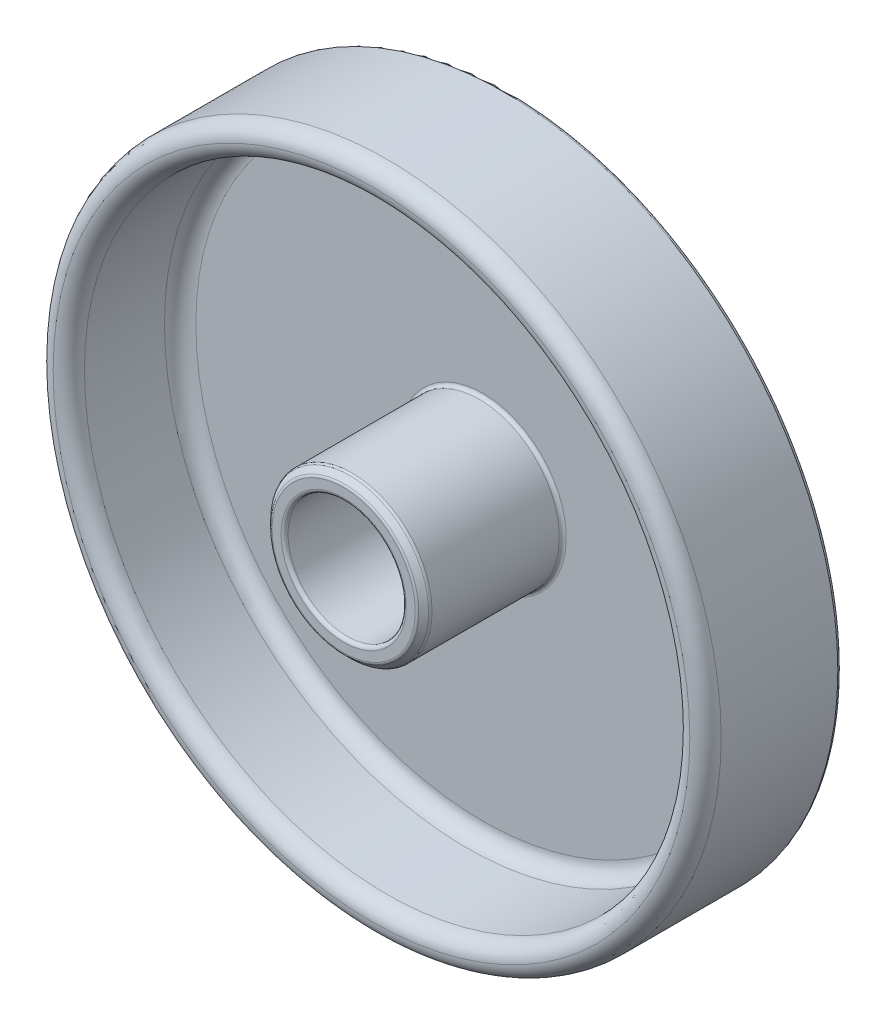
ISO-10303-21;
HEADER;
FILE_DESCRIPTION(('STEP AP214'),'2;1');
FILE_NAME('part.step','',(''),(''),'','','');
FILE_SCHEMA(('AUTOMOTIVE_DESIGN { 1 0 10303 214 1 1 1 1 }'));
ENDSEC;
DATA;
#1=APPLICATION_CONTEXT('core data for automotive mechanical design processes');
#2=APPLICATION_PROTOCOL_DEFINITION('international standard','automotive_design',2000,#1);
#3=PRODUCT_CONTEXT('',#1,'mechanical');
#4=PRODUCT('Part','Part','',(#3));
#5=PRODUCT_RELATED_PRODUCT_CATEGORY('part','',(#4));
#6=PRODUCT_DEFINITION_FORMATION('','',#4);
#7=PRODUCT_DEFINITION_CONTEXT('part definition',#1,'design');
#8=PRODUCT_DEFINITION('design','',#6,#7);
#9=PRODUCT_DEFINITION_SHAPE('','',#8);
#10=(LENGTH_UNIT() NAMED_UNIT(*) SI_UNIT(.MILLI.,.METRE.));
#11=(NAMED_UNIT(*) PLANE_ANGLE_UNIT() SI_UNIT($,.RADIAN.));
#12=(NAMED_UNIT(*) SI_UNIT($,.STERADIAN.) SOLID_ANGLE_UNIT());
#13=UNCERTAINTY_MEASURE_WITH_UNIT(LENGTH_MEASURE(1.E-05),#10,'distance_accuracy_value','');
#14=(GEOMETRIC_REPRESENTATION_CONTEXT(3) GLOBAL_UNCERTAINTY_ASSIGNED_CONTEXT((#13)) GLOBAL_UNIT_ASSIGNED_CONTEXT((#10,
#11,#12)) REPRESENTATION_CONTEXT('',''));
#15=CARTESIAN_POINT('',(0.,0.,0.));
#16=DIRECTION('',(0.,0.,1.));
#17=DIRECTION('',(1.,0.,0.));
#18=AXIS2_PLACEMENT_3D('',#15,#16,#17);
#19=CARTESIAN_POINT('',(0.,0.,-319.213461987817));
#20=DIRECTION('',(0.,0.,1.));
#21=DIRECTION('',(1.,0.,0.));
#22=AXIS2_PLACEMENT_3D('',#19,#20,#21);
#23=CYLINDRICAL_SURFACE('',#22,48.);
#24=CARTESIAN_POINT('',(0.,0.,-103.92448));
#25=DIRECTION('',(0.,0.,-1.));
#26=DIRECTION('',(-1.,0.,0.));
#27=AXIS2_PLACEMENT_3D('',#24,#25,#26);
#28=CIRCLE('',#27,48.);
#29=CARTESIAN_POINT('',(-48.,0.,-103.92448));
#30=VERTEX_POINT('',#29);
#31=EDGE_CURVE('E75',#30,#30,#28,.F.);
#32=ORIENTED_EDGE('',*,*,#31,.T.);
#33=EDGE_LOOP('',(#32));
#34=FACE_BOUND('',#33,.T.);
#35=CARTESIAN_POINT('',(0.,0.,-87.15));
#36=DIRECTION('',(0.,0.,1.));
#37=DIRECTION('',(1.,0.,0.));
#38=AXIS2_PLACEMENT_3D('',#35,#36,#37);
#39=CIRCLE('',#38,48.);
#40=CARTESIAN_POINT('',(48.,0.,-87.15));
#41=VERTEX_POINT('',#40);
#42=EDGE_CURVE('E87',#41,#41,#39,.F.);
#43=ORIENTED_EDGE('',*,*,#42,.T.);
#44=EDGE_LOOP('',(#43));
#45=FACE_BOUND('',#44,.T.);
#46=ADVANCED_FACE('F37',(#34,#45),#23,.T.);
#47=CARTESIAN_POINT('',(0.,0.,-104.42448));
#48=DIRECTION('',(0.,0.,-1.));
#49=DIRECTION('',(1.,0.,0.));
#50=AXIS2_PLACEMENT_3D('',#47,#48,#49);
#51=PLANE('',#50);
#52=CARTESIAN_POINT('',(0.,0.,-104.42448));
#53=DIRECTION('',(0.,0.,-1.));
#54=DIRECTION('',(-1.,0.,0.));
#55=AXIS2_PLACEMENT_3D('',#52,#53,#54);
#56=CIRCLE('',#55,43.5);
#57=CARTESIAN_POINT('',(-43.5,0.,-104.42448));
#58=VERTEX_POINT('',#57);
#59=EDGE_CURVE('E78',#58,#58,#56,.F.);
#60=ORIENTED_EDGE('',*,*,#59,.T.);
#61=EDGE_LOOP('',(#60));
#62=FACE_BOUND('',#61,.T.);
#63=CARTESIAN_POINT('',(0.,0.,-104.42448));
#64=DIRECTION('',(0.,0.,-1.));
#65=DIRECTION('',(-1.,0.,0.));
#66=AXIS2_PLACEMENT_3D('',#63,#64,#65);
#67=CIRCLE('',#66,47.5);
#68=CARTESIAN_POINT('',(-47.5,0.,-104.42448));
#69=VERTEX_POINT('',#68);
#70=EDGE_CURVE('E81',#69,#69,#67,.T.);
#71=ORIENTED_EDGE('',*,*,#70,.T.);
#72=EDGE_LOOP('',(#71));
#73=FACE_BOUND('',#72,.T.);
#74=ADVANCED_FACE('F125',(#62,#73),#51,.T.);
#75=CARTESIAN_POINT('',(0.,0.,-84.9));
#76=DIRECTION('',(0.,0.,-1.));
#77=DIRECTION('',(-1.,0.,0.));
#78=AXIS2_PLACEMENT_3D('',#75,#76,#77);
#79=CYLINDRICAL_SURFACE('',#78,43.5);
#80=CARTESIAN_POINT('',(0.,0.,-98.65));
#81=DIRECTION('',(0.,0.,-1.));
#82=DIRECTION('',(-1.,0.,0.));
#83=AXIS2_PLACEMENT_3D('',#80,#81,#82);
#84=CIRCLE('',#83,43.5);
#85=CARTESIAN_POINT('',(-43.5,0.,-98.65));
#86=VERTEX_POINT('',#85);
#87=EDGE_CURVE('E94',#86,#86,#84,.T.);
#88=ORIENTED_EDGE('',*,*,#87,.T.);
#89=EDGE_LOOP('',(#88));
#90=FACE_BOUND('',#89,.T.);
#91=CARTESIAN_POINT('',(0.,0.,-87.15));
#92=DIRECTION('',(0.,0.,1.));
#93=DIRECTION('',(1.,0.,0.));
#94=AXIS2_PLACEMENT_3D('',#91,#92,#93);
#95=CIRCLE('',#94,43.5);
#96=CARTESIAN_POINT('',(43.5,0.,-87.15));
#97=VERTEX_POINT('',#96);
#98=EDGE_CURVE('E97',#97,#97,#95,.T.);
#99=ORIENTED_EDGE('',*,*,#98,.T.);
#100=EDGE_LOOP('',(#99));
#101=FACE_BOUND('',#100,.T.);
#102=ADVANCED_FACE('F120',(#90,#101),#79,.F.);
#103=CARTESIAN_POINT('',(0.,0.,-100.9));
#104=DIRECTION('',(0.,0.,-1.));
#105=DIRECTION('',(-1.,0.,0.));
#106=AXIS2_PLACEMENT_3D('',#103,#104,#105);
#107=PLANE('',#106);
#108=CARTESIAN_POINT('',(0.,0.,-100.9));
#109=DIRECTION('',(0.,0.,-1.));
#110=DIRECTION('',(-1.,0.,0.));
#111=AXIS2_PLACEMENT_3D('',#108,#109,#110);
#112=CIRCLE('',#111,12.);
#113=CARTESIAN_POINT('',(-12.,0.,-100.9));
#114=VERTEX_POINT('',#113);
#115=EDGE_CURVE('E57',#114,#114,#112,.T.);
#116=ORIENTED_EDGE('',*,*,#115,.T.);
#117=EDGE_LOOP('',(#116));
#118=FACE_BOUND('',#117,.T.);
#119=CARTESIAN_POINT('',(0.,0.,-100.9));
#120=DIRECTION('',(0.,0.,-1.));
#121=DIRECTION('',(-1.,0.,0.));
#122=AXIS2_PLACEMENT_3D('',#119,#120,#121);
#123=CIRCLE('',#122,41.25);
#124=CARTESIAN_POINT('',(-41.25,0.,-100.9));
#125=VERTEX_POINT('',#124);
#126=EDGE_CURVE('E100',#125,#125,#123,.F.);
#127=ORIENTED_EDGE('',*,*,#126,.T.);
#128=EDGE_LOOP('',(#127));
#129=FACE_BOUND('',#128,.T.);
#130=ADVANCED_FACE('F110',(#118,#129),#107,.F.);
#131=CARTESIAN_POINT('',(0.,0.,-103.42448));
#132=DIRECTION('',(0.,0.,-1.));
#133=DIRECTION('',(-1.,0.,0.));
#134=AXIS2_PLACEMENT_3D('',#131,#132,#133);
#135=CYLINDRICAL_SURFACE('',#134,43.);
#136=CARTESIAN_POINT('',(0.,0.,-103.92448));
#137=DIRECTION('',(0.,0.,-1.));
#138=DIRECTION('',(-1.,0.,0.));
#139=AXIS2_PLACEMENT_3D('',#136,#137,#138);
#140=CIRCLE('',#139,43.);
#141=CARTESIAN_POINT('',(-43.,0.,-103.92448));
#142=VERTEX_POINT('',#141);
#143=EDGE_CURVE('E84',#142,#142,#140,.T.);
#144=ORIENTED_EDGE('',*,*,#143,.T.);
#145=EDGE_LOOP('',(#144));
#146=FACE_BOUND('',#145,.T.);
#147=CARTESIAN_POINT('',(0.,0.,-103.42448));
#148=DIRECTION('',(0.,0.,-1.));
#149=DIRECTION('',(-1.,0.,0.));
#150=AXIS2_PLACEMENT_3D('',#147,#148,#149);
#151=CIRCLE('',#150,43.);
#152=CARTESIAN_POINT('',(-43.,0.,-103.42448));
#153=VERTEX_POINT('',#152);
#154=EDGE_CURVE('E91',#153,#153,#151,.T.);
#155=ORIENTED_EDGE('',*,*,#154,.F.);
#156=EDGE_LOOP('',(#155));
#157=FACE_BOUND('',#156,.T.);
#158=ADVANCED_FACE('F108',(#146,#157),#135,.F.);
#159=CARTESIAN_POINT('',(0.,0.,-103.42448));
#160=DIRECTION('',(0.,0.,-1.));
#161=DIRECTION('',(-1.,0.,0.));
#162=AXIS2_PLACEMENT_3D('',#159,#160,#161);
#163=PLANE('',#162);
#164=CARTESIAN_POINT('',(0.,0.,-103.42448));
#165=DIRECTION('',(0.,0.,-1.));
#166=DIRECTION('',(-1.,0.,0.));
#167=AXIS2_PLACEMENT_3D('',#164,#165,#166);
#168=CIRCLE('',#167,9.);
#169=CARTESIAN_POINT('',(-9.,0.,-103.42448));
#170=VERTEX_POINT('',#169);
#171=EDGE_CURVE('E66',#170,#170,#168,.F.);
#172=ORIENTED_EDGE('',*,*,#171,.T.);
#173=EDGE_LOOP('',(#172));
#174=FACE_BOUND('',#173,.T.);
#175=ORIENTED_EDGE('',*,*,#154,.T.);
#176=EDGE_LOOP('',(#175));
#177=FACE_BOUND('',#176,.T.);
#178=ADVANCED_FACE('F106',(#174,#177),#163,.T.);
#179=CARTESIAN_POINT('',(0.,0.,-98.65));
#180=DIRECTION('',(0.,0.,-1.));
#181=DIRECTION('',(-1.,0.,0.));
#182=AXIS2_PLACEMENT_3D('',#179,#180,#181);
#183=TOROIDAL_SURFACE('',#182,41.25,2.25);
#184=ORIENTED_EDGE('',*,*,#87,.F.);
#185=EDGE_LOOP('',(#184));
#186=FACE_BOUND('',#185,.T.);
#187=ORIENTED_EDGE('',*,*,#126,.F.);
#188=EDGE_LOOP('',(#187));
#189=FACE_BOUND('',#188,.T.);
#190=ADVANCED_FACE('F117',(#186,#189),#183,.F.);
#191=CARTESIAN_POINT('',(0.,0.,-87.15));
#192=DIRECTION('',(0.,0.,1.));
#193=DIRECTION('',(1.,0.,0.));
#194=AXIS2_PLACEMENT_3D('',#191,#192,#193);
#195=TOROIDAL_SURFACE('',#194,45.75,2.25);
#196=ORIENTED_EDGE('',*,*,#98,.F.);
#197=EDGE_LOOP('',(#196));
#198=FACE_BOUND('',#197,.T.);
#199=CARTESIAN_POINT('',(0.,0.,-84.9));
#200=DIRECTION('',(0.,0.,1.));
#201=DIRECTION('',(1.,0.,0.));
#202=AXIS2_PLACEMENT_3D('',#199,#200,#201);
#203=CIRCLE('',#202,45.75);
#204=CARTESIAN_POINT('',(45.75,0.,-84.9));
#205=VERTEX_POINT('',#204);
#206=EDGE_CURVE('E88',#205,#205,#203,.F.);
#207=ORIENTED_EDGE('',*,*,#206,.F.);
#208=EDGE_LOOP('',(#207));
#209=FACE_BOUND('',#208,.T.);
#210=ADVANCED_FACE('F137',(#198,#209),#195,.T.);
#211=CARTESIAN_POINT('',(0.,0.,-87.15));
#212=DIRECTION('',(0.,0.,1.));
#213=DIRECTION('',(1.,0.,0.));
#214=AXIS2_PLACEMENT_3D('',#211,#212,#213);
#215=TOROIDAL_SURFACE('',#214,45.75,2.25);
#216=ORIENTED_EDGE('',*,*,#42,.F.);
#217=EDGE_LOOP('',(#216));
#218=FACE_BOUND('',#217,.T.);
#219=ORIENTED_EDGE('',*,*,#206,.T.);
#220=EDGE_LOOP('',(#219));
#221=FACE_BOUND('',#220,.T.);
#222=ADVANCED_FACE('F139',(#218,#221),#215,.T.);
#223=CARTESIAN_POINT('',(0.,0.,-103.92448));
#224=DIRECTION('',(0.,0.,-1.));
#225=DIRECTION('',(-1.,0.,0.));
#226=AXIS2_PLACEMENT_3D('',#223,#224,#225);
#227=TOROIDAL_SURFACE('',#226,43.5,0.5);
#228=ORIENTED_EDGE('',*,*,#59,.F.);
#229=EDGE_LOOP('',(#228));
#230=FACE_BOUND('',#229,.T.);
#231=ORIENTED_EDGE('',*,*,#143,.F.);
#232=EDGE_LOOP('',(#231));
#233=FACE_BOUND('',#232,.T.);
#234=ADVANCED_FACE('F142',(#230,#233),#227,.T.);
#235=CARTESIAN_POINT('',(0.,0.,-103.92448));
#236=DIRECTION('',(0.,0.,-1.));
#237=DIRECTION('',(-1.,0.,0.));
#238=AXIS2_PLACEMENT_3D('',#235,#236,#237);
#239=TOROIDAL_SURFACE('',#238,47.5,0.5);
#240=ORIENTED_EDGE('',*,*,#31,.F.);
#241=EDGE_LOOP('',(#240));
#242=FACE_BOUND('',#241,.T.);
#243=ORIENTED_EDGE('',*,*,#70,.F.);
#244=EDGE_LOOP('',(#243));
#245=FACE_BOUND('',#244,.T.);
#246=ADVANCED_FACE('F149',(#242,#245),#239,.T.);
#247=CARTESIAN_POINT('',(0.,0.,-80.9));
#248=DIRECTION('',(0.,0.,-1.));
#249=DIRECTION('',(-1.,0.,0.));
#250=AXIS2_PLACEMENT_3D('',#247,#248,#249);
#251=CYLINDRICAL_SURFACE('',#250,11.5);
#252=CARTESIAN_POINT('',(0.,0.,-100.4));
#253=DIRECTION('',(0.,0.,-1.));
#254=DIRECTION('',(-1.,0.,0.));
#255=AXIS2_PLACEMENT_3D('',#252,#253,#254);
#256=CIRCLE('',#255,11.5);
#257=CARTESIAN_POINT('',(-11.5,0.,-100.4));
#258=VERTEX_POINT('',#257);
#259=EDGE_CURVE('E60',#258,#258,#256,.F.);
#260=ORIENTED_EDGE('',*,*,#259,.T.);
#261=EDGE_LOOP('',(#260));
#262=FACE_BOUND('',#261,.T.);
#263=CARTESIAN_POINT('',(0.,0.,-82.1071067811865));
#264=DIRECTION('',(0.,0.,1.));
#265=DIRECTION('',(1.,0.,0.));
#266=AXIS2_PLACEMENT_3D('',#263,#264,#265);
#267=CIRCLE('',#266,11.5);
#268=CARTESIAN_POINT('',(11.5,0.,-82.1071067811865));
#269=VERTEX_POINT('',#268);
#270=EDGE_CURVE('E63',#269,#269,#267,.F.);
#271=ORIENTED_EDGE('',*,*,#270,.T.);
#272=EDGE_LOOP('',(#271));
#273=FACE_BOUND('',#272,.T.);
#274=ADVANCED_FACE('F153',(#262,#273),#251,.T.);
#275=CARTESIAN_POINT('',(0.,0.,-80.9));
#276=DIRECTION('',(0.,0.,-1.));
#277=DIRECTION('',(-1.,0.,0.));
#278=AXIS2_PLACEMENT_3D('',#275,#276,#277);
#279=PLANE('',#278);
#280=CARTESIAN_POINT('',(0.,0.,-80.9));
#281=DIRECTION('',(0.,0.,-1.));
#282=DIRECTION('',(-1.,0.,0.));
#283=AXIS2_PLACEMENT_3D('',#280,#281,#282);
#284=CIRCLE('',#283,9.);
#285=CARTESIAN_POINT('',(-9.,0.,-80.9));
#286=VERTEX_POINT('',#285);
#287=EDGE_CURVE('E48',#286,#286,#284,.T.);
#288=ORIENTED_EDGE('',*,*,#287,.T.);
#289=EDGE_LOOP('',(#288));
#290=FACE_BOUND('',#289,.T.);
#291=CARTESIAN_POINT('',(0.,0.,-80.9));
#292=DIRECTION('',(0.,0.,-1.));
#293=DIRECTION('',(-1.,0.,0.));
#294=AXIS2_PLACEMENT_3D('',#291,#292,#293);
#295=CIRCLE('',#294,10.2928932188135);
#296=CARTESIAN_POINT('',(-10.2928932188135,0.,-80.9));
#297=VERTEX_POINT('',#296);
#298=EDGE_CURVE('E52',#297,#297,#295,.F.);
#299=ORIENTED_EDGE('',*,*,#298,.T.);
#300=EDGE_LOOP('',(#299));
#301=FACE_BOUND('',#300,.T.);
#302=ADVANCED_FACE('F162',(#290,#301),#279,.F.);
#303=CARTESIAN_POINT('',(0.,0.,-80.9));
#304=DIRECTION('',(0.,0.,-1.));
#305=DIRECTION('',(-1.,0.,0.));
#306=AXIS2_PLACEMENT_3D('',#303,#304,#305);
#307=CONICAL_SURFACE('',#306,10.5,0.78539816339745);
#308=CARTESIAN_POINT('',(0.,0.,-81.0464466094067));
#309=DIRECTION('',(0.,0.,-1.));
#310=DIRECTION('',(-1.,0.,0.));
#311=AXIS2_PLACEMENT_3D('',#308,#309,#310);
#312=CIRCLE('',#311,10.6464466094067);
#313=CARTESIAN_POINT('',(-10.6464466094067,0.,-81.0464466094067));
#314=VERTEX_POINT('',#313);
#315=EDGE_CURVE('E10',#314,#314,#312,.T.);
#316=ORIENTED_EDGE('',*,*,#315,.T.);
#317=EDGE_LOOP('',(#316));
#318=FACE_BOUND('',#317,.T.);
#319=CARTESIAN_POINT('',(0.,0.,-81.7535533905932));
#320=DIRECTION('',(0.,0.,-1.));
#321=DIRECTION('',(-1.,0.,0.));
#322=AXIS2_PLACEMENT_3D('',#319,#320,#321);
#323=CIRCLE('',#322,11.3535533905933);
#324=CARTESIAN_POINT('',(-11.3535533905933,0.,-81.7535533905932));
#325=VERTEX_POINT('',#324);
#326=EDGE_CURVE('E44',#325,#325,#323,.F.);
#327=ORIENTED_EDGE('',*,*,#326,.T.);
#328=EDGE_LOOP('',(#327));
#329=FACE_BOUND('',#328,.T.);
#330=ADVANCED_FACE('F156',(#318,#329),#307,.T.);
#331=CARTESIAN_POINT('',(0.,0.,-104.42448));
#332=DIRECTION('',(0.,0.,1.));
#333=DIRECTION('',(1.,0.,0.));
#334=AXIS2_PLACEMENT_3D('',#331,#332,#333);
#335=CYLINDRICAL_SURFACE('',#334,8.5);
#336=CARTESIAN_POINT('',(0.,0.,-102.92448));
#337=DIRECTION('',(0.,0.,-1.));
#338=DIRECTION('',(-1.,0.,0.));
#339=AXIS2_PLACEMENT_3D('',#336,#337,#338);
#340=CIRCLE('',#339,8.5);
#341=CARTESIAN_POINT('',(-8.5,0.,-102.92448));
#342=VERTEX_POINT('',#341);
#343=EDGE_CURVE('E69',#342,#342,#340,.T.);
#344=ORIENTED_EDGE('',*,*,#343,.T.);
#345=EDGE_LOOP('',(#344));
#346=FACE_BOUND('',#345,.T.);
#347=CARTESIAN_POINT('',(0.,0.,-81.4));
#348=DIRECTION('',(0.,0.,-1.));
#349=DIRECTION('',(-1.,0.,0.));
#350=AXIS2_PLACEMENT_3D('',#347,#348,#349);
#351=CIRCLE('',#350,8.5);
#352=CARTESIAN_POINT('',(-8.5,0.,-81.4));
#353=VERTEX_POINT('',#352);
#354=EDGE_CURVE('E72',#353,#353,#351,.F.);
#355=ORIENTED_EDGE('',*,*,#354,.T.);
#356=EDGE_LOOP('',(#355));
#357=FACE_BOUND('',#356,.T.);
#358=ADVANCED_FACE('F161',(#346,#357),#335,.F.);
#359=CARTESIAN_POINT('',(0.,0.,-102.92448));
#360=DIRECTION('',(0.,0.,-1.));
#361=DIRECTION('',(-1.,0.,0.));
#362=AXIS2_PLACEMENT_3D('',#359,#360,#361);
#363=TOROIDAL_SURFACE('',#362,9.,0.5);
#364=ORIENTED_EDGE('',*,*,#171,.F.);
#365=EDGE_LOOP('',(#364));
#366=FACE_BOUND('',#365,.T.);
#367=ORIENTED_EDGE('',*,*,#343,.F.);
#368=EDGE_LOOP('',(#367));
#369=FACE_BOUND('',#368,.T.);
#370=ADVANCED_FACE('F163',(#366,#369),#363,.T.);
#371=CARTESIAN_POINT('',(0.,0.,-100.4));
#372=DIRECTION('',(0.,0.,-1.));
#373=DIRECTION('',(-1.,0.,0.));
#374=AXIS2_PLACEMENT_3D('',#371,#372,#373);
#375=TOROIDAL_SURFACE('',#374,12.,0.5);
#376=ORIENTED_EDGE('',*,*,#115,.F.);
#377=EDGE_LOOP('',(#376));
#378=FACE_BOUND('',#377,.T.);
#379=ORIENTED_EDGE('',*,*,#259,.F.);
#380=EDGE_LOOP('',(#379));
#381=FACE_BOUND('',#380,.T.);
#382=ADVANCED_FACE('F166',(#378,#381),#375,.F.);
#383=CARTESIAN_POINT('',(0.,0.,-81.4));
#384=DIRECTION('',(0.,0.,-1.));
#385=DIRECTION('',(-1.,0.,0.));
#386=AXIS2_PLACEMENT_3D('',#383,#384,#385);
#387=TOROIDAL_SURFACE('',#386,9.,0.5);
#388=ORIENTED_EDGE('',*,*,#287,.F.);
#389=EDGE_LOOP('',(#388));
#390=FACE_BOUND('',#389,.T.);
#391=ORIENTED_EDGE('',*,*,#354,.F.);
#392=EDGE_LOOP('',(#391));
#393=FACE_BOUND('',#392,.T.);
#394=ADVANCED_FACE('F170',(#390,#393),#387,.T.);
#395=CARTESIAN_POINT('',(0.,0.,-81.4));
#396=DIRECTION('',(0.,0.,-1.));
#397=DIRECTION('',(-1.,0.,0.));
#398=AXIS2_PLACEMENT_3D('',#395,#396,#397);
#399=TOROIDAL_SURFACE('',#398,10.2928932188135,0.5);
#400=ORIENTED_EDGE('',*,*,#315,.F.);
#401=EDGE_LOOP('',(#400));
#402=FACE_BOUND('',#401,.T.);
#403=ORIENTED_EDGE('',*,*,#298,.F.);
#404=EDGE_LOOP('',(#403));
#405=FACE_BOUND('',#404,.T.);
#406=ADVANCED_FACE('F173',(#402,#405),#399,.T.);
#407=CARTESIAN_POINT('',(0.,0.,-82.1071067811865));
#408=DIRECTION('',(0.,0.,1.));
#409=DIRECTION('',(1.,0.,0.));
#410=AXIS2_PLACEMENT_3D('',#407,#408,#409);
#411=TOROIDAL_SURFACE('',#410,11.,0.5);
#412=ORIENTED_EDGE('',*,*,#326,.F.);
#413=EDGE_LOOP('',(#412));
#414=FACE_BOUND('',#413,.T.);
#415=ORIENTED_EDGE('',*,*,#270,.F.);
#416=EDGE_LOOP('',(#415));
#417=FACE_BOUND('',#416,.T.);
#418=ADVANCED_FACE('F39',(#414,#417),#411,.T.);
#419=CLOSED_SHELL('',(#46,#74,#102,#130,#158,#178,#190,#210,#222,#234,#246,#274,#302,#330,#358,
#370,#382,#394,#406,#418));
#420=MANIFOLD_SOLID_BREP('B2',#419);
#421=ADVANCED_BREP_SHAPE_REPRESENTATION('',(#18,#420),#14);
#422=SHAPE_DEFINITION_REPRESENTATION(#9,#421);
ENDSEC;
END-ISO-10303-21;
